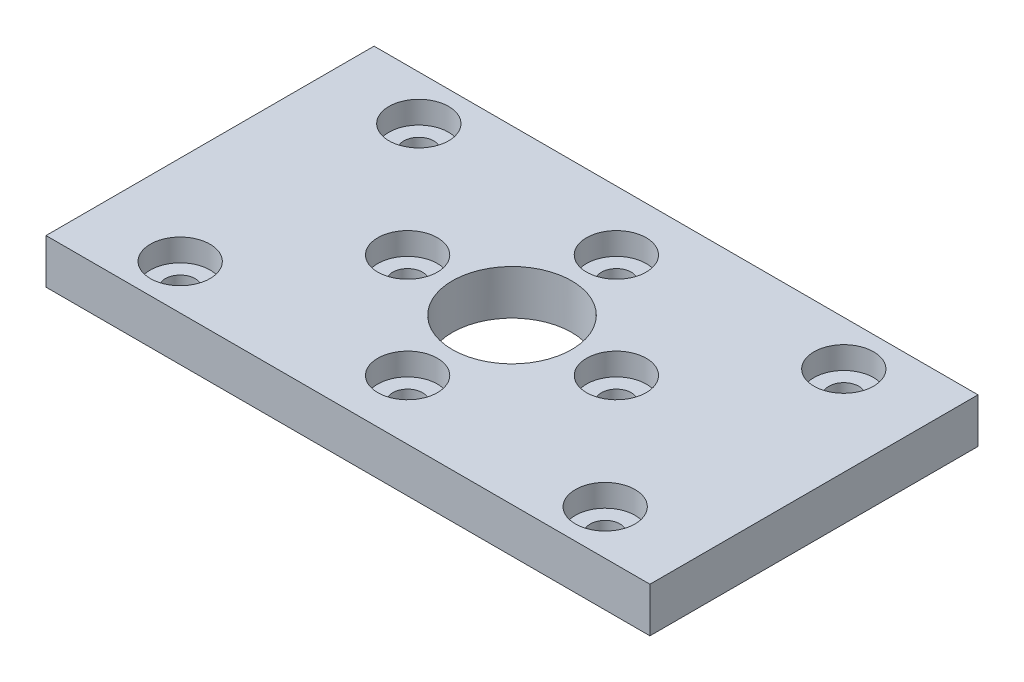
ISO-10303-21;
HEADER;
FILE_DESCRIPTION(('STEP AP214'),'2;1');
FILE_NAME('part.step','',(''),(''),'','','');
FILE_SCHEMA(('AUTOMOTIVE_DESIGN { 1 0 10303 214 1 1 1 1 }'));
ENDSEC;
DATA;
#1=APPLICATION_CONTEXT('core data for automotive mechanical design processes');
#2=APPLICATION_PROTOCOL_DEFINITION('international standard','automotive_design',2000,#1);
#3=PRODUCT_CONTEXT('',#1,'mechanical');
#4=PRODUCT('Part','Part','',(#3));
#5=PRODUCT_RELATED_PRODUCT_CATEGORY('part','',(#4));
#6=PRODUCT_DEFINITION_FORMATION('','',#4);
#7=PRODUCT_DEFINITION_CONTEXT('part definition',#1,'design');
#8=PRODUCT_DEFINITION('design','',#6,#7);
#9=PRODUCT_DEFINITION_SHAPE('','',#8);
#10=(LENGTH_UNIT() NAMED_UNIT(*) SI_UNIT(.MILLI.,.METRE.));
#11=(NAMED_UNIT(*) PLANE_ANGLE_UNIT() SI_UNIT($,.RADIAN.));
#12=(NAMED_UNIT(*) SI_UNIT($,.STERADIAN.) SOLID_ANGLE_UNIT());
#13=UNCERTAINTY_MEASURE_WITH_UNIT(LENGTH_MEASURE(1.E-05),#10,'distance_accuracy_value','');
#14=(GEOMETRIC_REPRESENTATION_CONTEXT(3) GLOBAL_UNCERTAINTY_ASSIGNED_CONTEXT((#13)) GLOBAL_UNIT_ASSIGNED_CONTEXT((#10,
#11,#12)) REPRESENTATION_CONTEXT('',''));
#15=CARTESIAN_POINT('',(0.,0.,0.));
#16=DIRECTION('',(0.,0.,1.));
#17=DIRECTION('',(1.,0.,0.));
#18=AXIS2_PLACEMENT_3D('',#15,#16,#17);
#19=CARTESIAN_POINT('',(14.25,-7.,8.));
#20=DIRECTION('',(0.,1.,0.));
#21=DIRECTION('',(0.,0.,1.));
#22=AXIS2_PLACEMENT_3D('',#19,#20,#21);
#23=CYLINDRICAL_SURFACE('',#22,1.);
#24=CARTESIAN_POINT('',(14.25,0.,8.));
#25=DIRECTION('',(0.,-1.,0.));
#26=DIRECTION('',(0.,0.,-1.));
#27=AXIS2_PLACEMENT_3D('',#24,#25,#26);
#28=CIRCLE('',#27,1.);
#29=CARTESIAN_POINT('',(14.25,0.,7.));
#30=VERTEX_POINT('',#29);
#31=EDGE_CURVE('E117',#30,#30,#28,.T.);
#32=ORIENTED_EDGE('',*,*,#31,.T.);
#33=EDGE_LOOP('',(#32));
#34=FACE_BOUND('',#33,.T.);
#35=CARTESIAN_POINT('',(14.25,1.5,8.));
#36=DIRECTION('',(0.,1.,0.));
#37=DIRECTION('',(0.,0.,1.));
#38=AXIS2_PLACEMENT_3D('',#35,#36,#37);
#39=CIRCLE('',#38,1.);
#40=CARTESIAN_POINT('',(14.25,1.5,9.));
#41=VERTEX_POINT('',#40);
#42=EDGE_CURVE('E157',#41,#41,#39,.F.);
#43=ORIENTED_EDGE('',*,*,#42,.F.);
#44=EDGE_LOOP('',(#43));
#45=FACE_BOUND('',#44,.T.);
#46=ADVANCED_FACE('F35',(#34,#45),#23,.F.);
#47=CARTESIAN_POINT('',(-14.25,-7.,8.));
#48=DIRECTION('',(0.,1.,0.));
#49=DIRECTION('',(0.,0.,1.));
#50=AXIS2_PLACEMENT_3D('',#47,#48,#49);
#51=CYLINDRICAL_SURFACE('',#50,1.);
#52=CARTESIAN_POINT('',(-14.25,0.,8.));
#53=DIRECTION('',(0.,-1.,0.));
#54=DIRECTION('',(0.,0.,-1.));
#55=AXIS2_PLACEMENT_3D('',#52,#53,#54);
#56=CIRCLE('',#55,1.);
#57=CARTESIAN_POINT('',(-14.25,0.,7.));
#58=VERTEX_POINT('',#57);
#59=EDGE_CURVE('E113',#58,#58,#56,.T.);
#60=ORIENTED_EDGE('',*,*,#59,.T.);
#61=EDGE_LOOP('',(#60));
#62=FACE_BOUND('',#61,.T.);
#63=CARTESIAN_POINT('',(-14.25,1.5,8.));
#64=DIRECTION('',(0.,1.,0.));
#65=DIRECTION('',(0.,0.,1.));
#66=AXIS2_PLACEMENT_3D('',#63,#64,#65);
#67=CIRCLE('',#66,1.);
#68=CARTESIAN_POINT('',(-14.25,1.5,9.));
#69=VERTEX_POINT('',#68);
#70=EDGE_CURVE('E155',#69,#69,#67,.F.);
#71=ORIENTED_EDGE('',*,*,#70,.F.);
#72=EDGE_LOOP('',(#71));
#73=FACE_BOUND('',#72,.T.);
#74=ADVANCED_FACE('F195',(#62,#73),#51,.F.);
#75=CARTESIAN_POINT('',(-6.9999999999998,-7.,1.98951966012828E-13));
#76=DIRECTION('',(0.,1.,0.));
#77=DIRECTION('',(0.,0.,1.));
#78=AXIS2_PLACEMENT_3D('',#75,#76,#77);
#79=CYLINDRICAL_SURFACE('',#78,1.00000000000032);
#80=CARTESIAN_POINT('',(-6.9999999999998,0.,1.98951966012828E-13));
#81=DIRECTION('',(0.,-1.,0.));
#82=DIRECTION('',(0.,0.,-1.));
#83=AXIS2_PLACEMENT_3D('',#80,#81,#82);
#84=CIRCLE('',#83,1.00000000000032);
#85=CARTESIAN_POINT('',(-6.9999999999998,0.,-1.00000000000012));
#86=VERTEX_POINT('',#85);
#87=EDGE_CURVE('E130',#86,#86,#84,.T.);
#88=ORIENTED_EDGE('',*,*,#87,.T.);
#89=EDGE_LOOP('',(#88));
#90=FACE_BOUND('',#89,.T.);
#91=CARTESIAN_POINT('',(-6.9999999999998,1.5,1.98951966012828E-13));
#92=DIRECTION('',(0.,1.,0.));
#93=DIRECTION('',(0.,0.,1.));
#94=AXIS2_PLACEMENT_3D('',#91,#92,#93);
#95=CIRCLE('',#94,1.00000000000032);
#96=CARTESIAN_POINT('',(-6.9999999999998,1.5,1.00000000000052));
#97=VERTEX_POINT('',#96);
#98=EDGE_CURVE('E149',#97,#97,#95,.F.);
#99=ORIENTED_EDGE('',*,*,#98,.F.);
#100=EDGE_LOOP('',(#99));
#101=FACE_BOUND('',#100,.T.);
#102=ADVANCED_FACE('F201',(#90,#101),#79,.F.);
#103=CARTESIAN_POINT('',(3.9618942650685E-13,-7.,7.));
#104=DIRECTION('',(0.,1.,0.));
#105=DIRECTION('',(0.,0.,1.));
#106=AXIS2_PLACEMENT_3D('',#103,#104,#105);
#107=CYLINDRICAL_SURFACE('',#106,1.00000000000043);
#108=CARTESIAN_POINT('',(3.9618942650685E-13,0.,7.));
#109=DIRECTION('',(0.,-1.,0.));
#110=DIRECTION('',(0.,0.,-1.));
#111=AXIS2_PLACEMENT_3D('',#108,#109,#110);
#112=CIRCLE('',#111,1.00000000000043);
#113=CARTESIAN_POINT('',(3.9618942650685E-13,0.,5.99999999999957));
#114=VERTEX_POINT('',#113);
#115=EDGE_CURVE('E133',#114,#114,#112,.T.);
#116=ORIENTED_EDGE('',*,*,#115,.T.);
#117=EDGE_LOOP('',(#116));
#118=FACE_BOUND('',#117,.T.);
#119=CARTESIAN_POINT('',(3.9618942650685E-13,1.5,7.));
#120=DIRECTION('',(0.,1.,0.));
#121=DIRECTION('',(0.,0.,1.));
#122=AXIS2_PLACEMENT_3D('',#119,#120,#121);
#123=CIRCLE('',#122,1.00000000000043);
#124=CARTESIAN_POINT('',(3.9618942650685E-13,1.5,8.00000000000042));
#125=VERTEX_POINT('',#124);
#126=EDGE_CURVE('E145',#125,#125,#123,.F.);
#127=ORIENTED_EDGE('',*,*,#126,.F.);
#128=EDGE_LOOP('',(#127));
#129=FACE_BOUND('',#128,.T.);
#130=ADVANCED_FACE('F225',(#118,#129),#107,.F.);
#131=CARTESIAN_POINT('',(7.0000000000002,-7.,-1.98094713253425E-13));
#132=DIRECTION('',(0.,1.,0.));
#133=DIRECTION('',(0.,0.,1.));
#134=AXIS2_PLACEMENT_3D('',#131,#132,#133);
#135=CYLINDRICAL_SURFACE('',#134,1.00000000000015);
#136=CARTESIAN_POINT('',(7.0000000000002,0.,-1.98094713253425E-13));
#137=DIRECTION('',(0.,-1.,0.));
#138=DIRECTION('',(0.,0.,-1.));
#139=AXIS2_PLACEMENT_3D('',#136,#137,#138);
#140=CIRCLE('',#139,1.00000000000015);
#141=CARTESIAN_POINT('',(7.0000000000002,0.,-1.00000000000035));
#142=VERTEX_POINT('',#141);
#143=EDGE_CURVE('E129',#142,#142,#140,.T.);
#144=ORIENTED_EDGE('',*,*,#143,.T.);
#145=EDGE_LOOP('',(#144));
#146=FACE_BOUND('',#145,.T.);
#147=CARTESIAN_POINT('',(7.0000000000002,1.5,-1.98094713253425E-13));
#148=DIRECTION('',(0.,1.,0.));
#149=DIRECTION('',(0.,0.,1.));
#150=AXIS2_PLACEMENT_3D('',#147,#148,#149);
#151=CIRCLE('',#150,1.00000000000015);
#152=CARTESIAN_POINT('',(7.0000000000002,1.5,0.999999999999957));
#153=VERTEX_POINT('',#152);
#154=EDGE_CURVE('E142',#153,#153,#151,.F.);
#155=ORIENTED_EDGE('',*,*,#154,.F.);
#156=EDGE_LOOP('',(#155));
#157=FACE_BOUND('',#156,.T.);
#158=ADVANCED_FACE('F220',(#146,#157),#135,.F.);
#159=CARTESIAN_POINT('',(20.25,3.,11.));
#160=DIRECTION('',(-1.,0.,0.));
#161=DIRECTION('',(0.,0.,1.));
#162=AXIS2_PLACEMENT_3D('',#159,#160,#161);
#163=PLANE('',#162);
#164=DIRECTION('',(0.,0.,-1.));
#165=VECTOR('',#164,1.);
#166=CARTESIAN_POINT('',(20.25,0.,11.));
#167=LINE('',#166,#165);
#168=CARTESIAN_POINT('',(20.25,0.,11.));
#169=VERTEX_POINT('',#168);
#170=CARTESIAN_POINT('',(20.25,0.,-11.));
#171=VERTEX_POINT('',#170);
#172=EDGE_CURVE('E102',#169,#171,#167,.T.);
#173=ORIENTED_EDGE('',*,*,#172,.T.);
#174=DIRECTION('',(0.,-1.,0.));
#175=VECTOR('',#174,1.);
#176=CARTESIAN_POINT('',(20.25,3.,-11.));
#177=LINE('',#176,#175);
#178=CARTESIAN_POINT('',(20.25,3.,-11.));
#179=VERTEX_POINT('',#178);
#180=EDGE_CURVE('E11',#179,#171,#177,.T.);
#181=ORIENTED_EDGE('',*,*,#180,.F.);
#182=DIRECTION('',(0.,0.,-1.));
#183=VECTOR('',#182,1.);
#184=CARTESIAN_POINT('',(20.25,3.,11.));
#185=LINE('',#184,#183);
#186=CARTESIAN_POINT('',(20.25,3.,11.));
#187=VERTEX_POINT('',#186);
#188=EDGE_CURVE('E89',#187,#179,#185,.T.);
#189=ORIENTED_EDGE('',*,*,#188,.F.);
#190=DIRECTION('',(0.,-1.,0.));
#191=VECTOR('',#190,1.);
#192=CARTESIAN_POINT('',(20.25,3.,11.));
#193=LINE('',#192,#191);
#194=EDGE_CURVE('E98',#187,#169,#193,.T.);
#195=ORIENTED_EDGE('',*,*,#194,.T.);
#196=EDGE_LOOP('',(#173,#181,#189,#195));
#197=FACE_BOUND('',#196,.T.);
#198=ADVANCED_FACE('F37',(#197),#163,.F.);
#199=CARTESIAN_POINT('',(-20.25,3.,-11.));
#200=DIRECTION('',(0.,0.,1.));
#201=DIRECTION('',(1.,0.,0.));
#202=AXIS2_PLACEMENT_3D('',#199,#200,#201);
#203=PLANE('',#202);
#204=DIRECTION('',(-1.,0.,0.));
#205=VECTOR('',#204,1.);
#206=CARTESIAN_POINT('',(-20.25,0.,-11.));
#207=LINE('',#206,#205);
#208=CARTESIAN_POINT('',(-20.25,0.,-11.));
#209=VERTEX_POINT('',#208);
#210=EDGE_CURVE('E93',#171,#209,#207,.T.);
#211=ORIENTED_EDGE('',*,*,#210,.T.);
#212=DIRECTION('',(0.,-1.,0.));
#213=VECTOR('',#212,1.);
#214=CARTESIAN_POINT('',(-20.25,3.,-11.));
#215=LINE('',#214,#213);
#216=CARTESIAN_POINT('',(-20.25,3.,-11.));
#217=VERTEX_POINT('',#216);
#218=EDGE_CURVE('E45',#217,#209,#215,.T.);
#219=ORIENTED_EDGE('',*,*,#218,.F.);
#220=DIRECTION('',(-1.,0.,0.));
#221=VECTOR('',#220,1.);
#222=CARTESIAN_POINT('',(-20.25,3.,-11.));
#223=LINE('',#222,#221);
#224=EDGE_CURVE('E84',#179,#217,#223,.T.);
#225=ORIENTED_EDGE('',*,*,#224,.F.);
#226=ORIENTED_EDGE('',*,*,#180,.T.);
#227=EDGE_LOOP('',(#211,#219,#225,#226));
#228=FACE_BOUND('',#227,.T.);
#229=ADVANCED_FACE('F92',(#228),#203,.F.);
#230=CARTESIAN_POINT('',(-20.25,3.,11.));
#231=DIRECTION('',(1.,0.,0.));
#232=DIRECTION('',(0.,0.,-1.));
#233=AXIS2_PLACEMENT_3D('',#230,#231,#232);
#234=PLANE('',#233);
#235=DIRECTION('',(0.,0.,1.));
#236=VECTOR('',#235,1.);
#237=CARTESIAN_POINT('',(-20.25,0.,11.));
#238=LINE('',#237,#236);
#239=CARTESIAN_POINT('',(-20.25,0.,11.));
#240=VERTEX_POINT('',#239);
#241=EDGE_CURVE('E71',#209,#240,#238,.T.);
#242=ORIENTED_EDGE('',*,*,#241,.T.);
#243=DIRECTION('',(0.,-1.,0.));
#244=VECTOR('',#243,1.);
#245=CARTESIAN_POINT('',(-20.25,3.,11.));
#246=LINE('',#245,#244);
#247=CARTESIAN_POINT('',(-20.25,3.,11.));
#248=VERTEX_POINT('',#247);
#249=EDGE_CURVE('E94',#248,#240,#246,.T.);
#250=ORIENTED_EDGE('',*,*,#249,.F.);
#251=DIRECTION('',(0.,0.,1.));
#252=VECTOR('',#251,1.);
#253=CARTESIAN_POINT('',(-20.25,3.,11.));
#254=LINE('',#253,#252);
#255=EDGE_CURVE('E87',#217,#248,#254,.T.);
#256=ORIENTED_EDGE('',*,*,#255,.F.);
#257=ORIENTED_EDGE('',*,*,#218,.T.);
#258=EDGE_LOOP('',(#242,#250,#256,#257));
#259=FACE_BOUND('',#258,.T.);
#260=ADVANCED_FACE('F96',(#259),#234,.F.);
#261=CARTESIAN_POINT('',(-20.25,3.,11.));
#262=DIRECTION('',(0.,0.,-1.));
#263=DIRECTION('',(-1.,0.,0.));
#264=AXIS2_PLACEMENT_3D('',#261,#262,#263);
#265=PLANE('',#264);
#266=DIRECTION('',(1.,0.,0.));
#267=VECTOR('',#266,1.);
#268=CARTESIAN_POINT('',(-20.25,0.,11.));
#269=LINE('',#268,#267);
#270=EDGE_CURVE('E77',#240,#169,#269,.T.);
#271=ORIENTED_EDGE('',*,*,#270,.T.);
#272=ORIENTED_EDGE('',*,*,#194,.F.);
#273=DIRECTION('',(1.,0.,0.));
#274=VECTOR('',#273,1.);
#275=CARTESIAN_POINT('',(-20.25,3.,11.));
#276=LINE('',#275,#274);
#277=EDGE_CURVE('E54',#248,#187,#276,.T.);
#278=ORIENTED_EDGE('',*,*,#277,.F.);
#279=ORIENTED_EDGE('',*,*,#249,.T.);
#280=EDGE_LOOP('',(#271,#272,#278,#279));
#281=FACE_BOUND('',#280,.T.);
#282=ADVANCED_FACE('F180',(#281),#265,.F.);
#283=CARTESIAN_POINT('',(0.,3.,0.));
#284=DIRECTION('',(0.,-1.,0.));
#285=DIRECTION('',(0.,0.,-1.));
#286=AXIS2_PLACEMENT_3D('',#283,#284,#285);
#287=PLANE('',#286);
#288=CARTESIAN_POINT('',(-14.25,3.,8.));
#289=DIRECTION('',(0.,1.,0.));
#290=DIRECTION('',(0.,0.,1.));
#291=AXIS2_PLACEMENT_3D('',#288,#289,#290);
#292=CIRCLE('',#291,2.);
#293=CARTESIAN_POINT('',(-14.25,3.,10.));
#294=VERTEX_POINT('',#293);
#295=EDGE_CURVE('E417',#294,#294,#292,.T.);
#296=ORIENTED_EDGE('',*,*,#295,.F.);
#297=EDGE_LOOP('',(#296));
#298=FACE_BOUND('',#297,.T.);
#299=CARTESIAN_POINT('',(3.9618942650685E-13,3.,7.));
#300=DIRECTION('',(0.,1.,0.));
#301=DIRECTION('',(0.,0.,1.));
#302=AXIS2_PLACEMENT_3D('',#299,#300,#301);
#303=CIRCLE('',#302,2.);
#304=CARTESIAN_POINT('',(3.9618942650685E-13,3.,9.));
#305=VERTEX_POINT('',#304);
#306=EDGE_CURVE('E423',#305,#305,#303,.T.);
#307=ORIENTED_EDGE('',*,*,#306,.F.);
#308=EDGE_LOOP('',(#307));
#309=FACE_BOUND('',#308,.T.);
#310=CARTESIAN_POINT('',(14.25,3.,8.));
#311=DIRECTION('',(0.,1.,0.));
#312=DIRECTION('',(0.,0.,1.));
#313=AXIS2_PLACEMENT_3D('',#310,#311,#312);
#314=CIRCLE('',#313,2.);
#315=CARTESIAN_POINT('',(14.25,3.,10.));
#316=VERTEX_POINT('',#315);
#317=EDGE_CURVE('E410',#316,#316,#314,.T.);
#318=ORIENTED_EDGE('',*,*,#317,.F.);
#319=EDGE_LOOP('',(#318));
#320=FACE_BOUND('',#319,.T.);
#321=CARTESIAN_POINT('',(-14.2500000000001,3.,-7.99999999999969));
#322=DIRECTION('',(0.,1.,0.));
#323=DIRECTION('',(0.,0.,-1.));
#324=AXIS2_PLACEMENT_3D('',#321,#322,#323);
#325=CIRCLE('',#324,2.);
#326=CARTESIAN_POINT('',(-14.2500000000001,3.,-9.99999999999969));
#327=VERTEX_POINT('',#326);
#328=EDGE_CURVE('E407',#327,#327,#325,.T.);
#329=ORIENTED_EDGE('',*,*,#328,.F.);
#330=EDGE_LOOP('',(#329));
#331=FACE_BOUND('',#330,.T.);
#332=CARTESIAN_POINT('',(-6.9999999999998,3.,1.98951966012828E-13));
#333=DIRECTION('',(0.,1.,0.));
#334=DIRECTION('',(0.,0.,1.));
#335=AXIS2_PLACEMENT_3D('',#332,#333,#334);
#336=CIRCLE('',#335,2.);
#337=CARTESIAN_POINT('',(-6.9999999999998,3.,2.0000000000002));
#338=VERTEX_POINT('',#337);
#339=EDGE_CURVE('E416',#338,#338,#336,.T.);
#340=ORIENTED_EDGE('',*,*,#339,.F.);
#341=EDGE_LOOP('',(#340));
#342=FACE_BOUND('',#341,.T.);
#343=CARTESIAN_POINT('',(7.0000000000002,3.,-1.98094713253425E-13));
#344=DIRECTION('',(0.,1.,0.));
#345=DIRECTION('',(0.,0.,1.));
#346=AXIS2_PLACEMENT_3D('',#343,#344,#345);
#347=CIRCLE('',#346,2.);
#348=CARTESIAN_POINT('',(7.0000000000002,3.,1.9999999999998));
#349=VERTEX_POINT('',#348);
#350=EDGE_CURVE('E435',#349,#349,#347,.T.);
#351=ORIENTED_EDGE('',*,*,#350,.F.);
#352=EDGE_LOOP('',(#351));
#353=FACE_BOUND('',#352,.T.);
#354=CARTESIAN_POINT('',(3.40678275275592E-13,3.,-6.99999999999981));
#355=DIRECTION('',(0.,1.,0.));
#356=DIRECTION('',(0.,0.,-1.));
#357=AXIS2_PLACEMENT_3D('',#354,#355,#356);
#358=CIRCLE('',#357,2.);
#359=CARTESIAN_POINT('',(3.40678275275592E-13,3.,-8.99999999999981));
#360=VERTEX_POINT('',#359);
#361=EDGE_CURVE('E429',#360,#360,#358,.T.);
#362=ORIENTED_EDGE('',*,*,#361,.F.);
#363=EDGE_LOOP('',(#362));
#364=FACE_BOUND('',#363,.T.);
#365=CARTESIAN_POINT('',(14.2499999999999,3.,-7.99999999999992));
#366=DIRECTION('',(0.,1.,0.));
#367=DIRECTION('',(0.,0.,-1.));
#368=AXIS2_PLACEMENT_3D('',#365,#366,#367);
#369=CIRCLE('',#368,2.);
#370=CARTESIAN_POINT('',(14.2499999999999,3.,-9.99999999999991));
#371=VERTEX_POINT('',#370);
#372=EDGE_CURVE('E162',#371,#371,#369,.T.);
#373=ORIENTED_EDGE('',*,*,#372,.F.);
#374=EDGE_LOOP('',(#373));
#375=FACE_BOUND('',#374,.T.);
#376=CARTESIAN_POINT('',(0.,3.,0.));
#377=DIRECTION('',(0.,1.,0.));
#378=DIRECTION('',(0.,0.,1.));
#379=AXIS2_PLACEMENT_3D('',#376,#377,#378);
#380=CIRCLE('',#379,4.);
#381=CARTESIAN_POINT('',(0.,3.,4.));
#382=VERTEX_POINT('',#381);
#383=EDGE_CURVE('E125',#382,#382,#380,.T.);
#384=ORIENTED_EDGE('',*,*,#383,.F.);
#385=EDGE_LOOP('',(#384));
#386=FACE_BOUND('',#385,.T.);
#387=ORIENTED_EDGE('',*,*,#188,.T.);
#388=ORIENTED_EDGE('',*,*,#224,.T.);
#389=ORIENTED_EDGE('',*,*,#255,.T.);
#390=ORIENTED_EDGE('',*,*,#277,.T.);
#391=EDGE_LOOP('',(#387,#388,#389,#390));
#392=FACE_BOUND('',#391,.T.);
#393=ADVANCED_FACE('F85',(#298,#309,#320,#331,#342,#353,#364,#375,#386,#392),#287,.F.);
#394=CARTESIAN_POINT('',(0.,0.,0.));
#395=DIRECTION('',(0.,-1.,0.));
#396=DIRECTION('',(0.,0.,-1.));
#397=AXIS2_PLACEMENT_3D('',#394,#395,#396);
#398=PLANE('',#397);
#399=ORIENTED_EDGE('',*,*,#143,.F.);
#400=EDGE_LOOP('',(#399));
#401=FACE_BOUND('',#400,.T.);
#402=ORIENTED_EDGE('',*,*,#115,.F.);
#403=EDGE_LOOP('',(#402));
#404=FACE_BOUND('',#403,.T.);
#405=ORIENTED_EDGE('',*,*,#87,.F.);
#406=EDGE_LOOP('',(#405));
#407=FACE_BOUND('',#406,.T.);
#408=CARTESIAN_POINT('',(0.,0.,-7.));
#409=DIRECTION('',(0.,-1.,0.));
#410=DIRECTION('',(0.,0.,-1.));
#411=AXIS2_PLACEMENT_3D('',#408,#409,#410);
#412=CIRCLE('',#411,1.);
#413=CARTESIAN_POINT('',(0.,0.,-8.));
#414=VERTEX_POINT('',#413);
#415=EDGE_CURVE('E126',#414,#414,#412,.T.);
#416=ORIENTED_EDGE('',*,*,#415,.F.);
#417=EDGE_LOOP('',(#416));
#418=FACE_BOUND('',#417,.T.);
#419=CARTESIAN_POINT('',(0.,0.,0.));
#420=DIRECTION('',(0.,-1.,0.));
#421=DIRECTION('',(0.,0.,-1.));
#422=AXIS2_PLACEMENT_3D('',#419,#420,#421);
#423=CIRCLE('',#422,4.);
#424=CARTESIAN_POINT('',(0.,0.,-4.));
#425=VERTEX_POINT('',#424);
#426=EDGE_CURVE('E118',#425,#425,#423,.T.);
#427=ORIENTED_EDGE('',*,*,#426,.F.);
#428=EDGE_LOOP('',(#427));
#429=FACE_BOUND('',#428,.T.);
#430=ORIENTED_EDGE('',*,*,#59,.F.);
#431=EDGE_LOOP('',(#430));
#432=FACE_BOUND('',#431,.T.);
#433=ORIENTED_EDGE('',*,*,#31,.F.);
#434=EDGE_LOOP('',(#433));
#435=FACE_BOUND('',#434,.T.);
#436=CARTESIAN_POINT('',(14.25,0.,-7.99999999999999));
#437=DIRECTION('',(0.,-1.,0.));
#438=DIRECTION('',(0.,0.,-1.));
#439=AXIS2_PLACEMENT_3D('',#436,#437,#438);
#440=CIRCLE('',#439,0.999999999999999);
#441=CARTESIAN_POINT('',(14.25,0.,-8.99999999999999));
#442=VERTEX_POINT('',#441);
#443=EDGE_CURVE('E114',#442,#442,#440,.T.);
#444=ORIENTED_EDGE('',*,*,#443,.F.);
#445=EDGE_LOOP('',(#444));
#446=FACE_BOUND('',#445,.T.);
#447=CARTESIAN_POINT('',(-14.25,0.,-8.));
#448=DIRECTION('',(0.,-1.,0.));
#449=DIRECTION('',(0.,0.,-1.));
#450=AXIS2_PLACEMENT_3D('',#447,#448,#449);
#451=CIRCLE('',#450,0.999999999999999);
#452=CARTESIAN_POINT('',(-14.25,0.,-9.));
#453=VERTEX_POINT('',#452);
#454=EDGE_CURVE('E105',#453,#453,#451,.T.);
#455=ORIENTED_EDGE('',*,*,#454,.F.);
#456=EDGE_LOOP('',(#455));
#457=FACE_BOUND('',#456,.T.);
#458=ORIENTED_EDGE('',*,*,#172,.F.);
#459=ORIENTED_EDGE('',*,*,#270,.F.);
#460=ORIENTED_EDGE('',*,*,#241,.F.);
#461=ORIENTED_EDGE('',*,*,#210,.F.);
#462=EDGE_LOOP('',(#458,#459,#460,#461));
#463=FACE_BOUND('',#462,.T.);
#464=ADVANCED_FACE('F179',(#401,#404,#407,#418,#429,#432,#435,#446,#457,#463),#398,.T.);
#465=CARTESIAN_POINT('',(-14.25,-7.,-8.));
#466=DIRECTION('',(0.,1.,0.));
#467=DIRECTION('',(0.,0.,1.));
#468=AXIS2_PLACEMENT_3D('',#465,#466,#467);
#469=CYLINDRICAL_SURFACE('',#468,0.999999999999999);
#470=CARTESIAN_POINT('',(-14.25,1.5,-8.));
#471=DIRECTION('',(0.,-1.,0.));
#472=DIRECTION('',(0.,0.,-1.));
#473=AXIS2_PLACEMENT_3D('',#470,#471,#472);
#474=CIRCLE('',#473,0.999999999999999);
#475=CARTESIAN_POINT('',(-14.25,1.5,-9.));
#476=VERTEX_POINT('',#475);
#477=EDGE_CURVE('E39',#476,#476,#474,.F.);
#478=ORIENTED_EDGE('',*,*,#477,.T.);
#479=EDGE_LOOP('',(#478));
#480=FACE_BOUND('',#479,.T.);
#481=ORIENTED_EDGE('',*,*,#454,.T.);
#482=EDGE_LOOP('',(#481));
#483=FACE_BOUND('',#482,.T.);
#484=ADVANCED_FACE('F187',(#480,#483),#469,.F.);
#485=CARTESIAN_POINT('',(14.25,-7.,-7.99999999999999));
#486=DIRECTION('',(0.,1.,0.));
#487=DIRECTION('',(0.,0.,1.));
#488=AXIS2_PLACEMENT_3D('',#485,#486,#487);
#489=CYLINDRICAL_SURFACE('',#488,0.999999999999999);
#490=CARTESIAN_POINT('',(14.25,1.5,-7.99999999999999));
#491=DIRECTION('',(0.,-1.,0.));
#492=DIRECTION('',(0.,0.,-1.));
#493=AXIS2_PLACEMENT_3D('',#490,#491,#492);
#494=CIRCLE('',#493,0.999999999999999);
#495=CARTESIAN_POINT('',(14.25,1.5,-8.99999999999999));
#496=VERTEX_POINT('',#495);
#497=EDGE_CURVE('E134',#496,#496,#494,.F.);
#498=ORIENTED_EDGE('',*,*,#497,.T.);
#499=EDGE_LOOP('',(#498));
#500=FACE_BOUND('',#499,.T.);
#501=ORIENTED_EDGE('',*,*,#443,.T.);
#502=EDGE_LOOP('',(#501));
#503=FACE_BOUND('',#502,.T.);
#504=ADVANCED_FACE('F207',(#500,#503),#489,.F.);
#505=CARTESIAN_POINT('',(0.,-7.,0.));
#506=DIRECTION('',(0.,1.,0.));
#507=DIRECTION('',(0.,0.,1.));
#508=AXIS2_PLACEMENT_3D('',#505,#506,#507);
#509=CYLINDRICAL_SURFACE('',#508,4.);
#510=ORIENTED_EDGE('',*,*,#426,.T.);
#511=EDGE_LOOP('',(#510));
#512=FACE_BOUND('',#511,.T.);
#513=ORIENTED_EDGE('',*,*,#383,.T.);
#514=EDGE_LOOP('',(#513));
#515=FACE_BOUND('',#514,.T.);
#516=ADVANCED_FACE('F176',(#512,#515),#509,.F.);
#517=CARTESIAN_POINT('',(0.,-7.,-7.));
#518=DIRECTION('',(0.,1.,0.));
#519=DIRECTION('',(0.,0.,1.));
#520=AXIS2_PLACEMENT_3D('',#517,#518,#519);
#521=CYLINDRICAL_SURFACE('',#520,1.);
#522=CARTESIAN_POINT('',(0.,1.5,-7.));
#523=DIRECTION('',(0.,-1.,0.));
#524=DIRECTION('',(0.,0.,-1.));
#525=AXIS2_PLACEMENT_3D('',#522,#523,#524);
#526=CIRCLE('',#525,1.);
#527=CARTESIAN_POINT('',(0.,1.5,-8.));
#528=VERTEX_POINT('',#527);
#529=EDGE_CURVE('E152',#528,#528,#526,.F.);
#530=ORIENTED_EDGE('',*,*,#529,.T.);
#531=EDGE_LOOP('',(#530));
#532=FACE_BOUND('',#531,.T.);
#533=ORIENTED_EDGE('',*,*,#415,.T.);
#534=EDGE_LOOP('',(#533));
#535=FACE_BOUND('',#534,.T.);
#536=ADVANCED_FACE('F241',(#532,#535),#521,.F.);
#537=CARTESIAN_POINT('',(14.2499999999999,1.5,-7.99999999999992));
#538=DIRECTION('',(0.,-1.,0.));
#539=DIRECTION('',(0.,0.,-1.));
#540=AXIS2_PLACEMENT_3D('',#537,#538,#539);
#541=PLANE('',#540);
#542=CARTESIAN_POINT('',(14.2499999999999,1.5,-7.99999999999992));
#543=DIRECTION('',(0.,1.,0.));
#544=DIRECTION('',(0.,0.,-1.));
#545=AXIS2_PLACEMENT_3D('',#542,#543,#544);
#546=CIRCLE('',#545,2.);
#547=CARTESIAN_POINT('',(14.2499999999999,1.5,-9.99999999999991));
#548=VERTEX_POINT('',#547);
#549=EDGE_CURVE('E141',#548,#548,#546,.T.);
#550=ORIENTED_EDGE('',*,*,#549,.T.);
#551=EDGE_LOOP('',(#550));
#552=FACE_BOUND('',#551,.T.);
#553=ORIENTED_EDGE('',*,*,#497,.F.);
#554=EDGE_LOOP('',(#553));
#555=FACE_BOUND('',#554,.T.);
#556=ADVANCED_FACE('F243',(#552,#555),#541,.F.);
#557=CARTESIAN_POINT('',(14.2499999999999,1.5,-7.99999999999992));
#558=DIRECTION('',(0.,1.,0.));
#559=DIRECTION('',(0.,0.,1.));
#560=AXIS2_PLACEMENT_3D('',#557,#558,#559);
#561=CYLINDRICAL_SURFACE('',#560,2.);
#562=ORIENTED_EDGE('',*,*,#549,.F.);
#563=EDGE_LOOP('',(#562));
#564=FACE_BOUND('',#563,.T.);
#565=ORIENTED_EDGE('',*,*,#372,.T.);
#566=EDGE_LOOP('',(#565));
#567=FACE_BOUND('',#566,.T.);
#568=ADVANCED_FACE('F235',(#564,#567),#561,.F.);
#569=CARTESIAN_POINT('',(7.0000000000002,1.5,-1.98094713253425E-13));
#570=DIRECTION('',(0.,1.,0.));
#571=DIRECTION('',(0.,0.,1.));
#572=AXIS2_PLACEMENT_3D('',#569,#570,#571);
#573=PLANE('',#572);
#574=CARTESIAN_POINT('',(7.0000000000002,1.5,-1.98094713253425E-13));
#575=DIRECTION('',(0.,1.,0.));
#576=DIRECTION('',(0.,0.,1.));
#577=AXIS2_PLACEMENT_3D('',#574,#575,#576);
#578=CIRCLE('',#577,2.);
#579=CARTESIAN_POINT('',(7.0000000000002,1.5,1.9999999999998));
#580=VERTEX_POINT('',#579);
#581=EDGE_CURVE('E432',#580,#580,#578,.T.);
#582=ORIENTED_EDGE('',*,*,#581,.T.);
#583=EDGE_LOOP('',(#582));
#584=FACE_BOUND('',#583,.T.);
#585=ORIENTED_EDGE('',*,*,#154,.T.);
#586=EDGE_LOOP('',(#585));
#587=FACE_BOUND('',#586,.T.);
#588=ADVANCED_FACE('F296',(#584,#587),#573,.T.);
#589=CARTESIAN_POINT('',(7.0000000000002,1.5,-1.98094713253425E-13));
#590=DIRECTION('',(0.,1.,0.));
#591=DIRECTION('',(0.,0.,1.));
#592=AXIS2_PLACEMENT_3D('',#589,#590,#591);
#593=CYLINDRICAL_SURFACE('',#592,2.);
#594=ORIENTED_EDGE('',*,*,#581,.F.);
#595=EDGE_LOOP('',(#594));
#596=FACE_BOUND('',#595,.T.);
#597=ORIENTED_EDGE('',*,*,#350,.T.);
#598=EDGE_LOOP('',(#597));
#599=FACE_BOUND('',#598,.T.);
#600=ADVANCED_FACE('F286',(#596,#599),#593,.F.);
#601=CARTESIAN_POINT('',(3.9618942650685E-13,1.5,7.));
#602=DIRECTION('',(0.,1.,0.));
#603=DIRECTION('',(0.,0.,1.));
#604=AXIS2_PLACEMENT_3D('',#601,#602,#603);
#605=PLANE('',#604);
#606=CARTESIAN_POINT('',(3.9618942650685E-13,1.5,7.));
#607=DIRECTION('',(0.,1.,0.));
#608=DIRECTION('',(0.,0.,1.));
#609=AXIS2_PLACEMENT_3D('',#606,#607,#608);
#610=CIRCLE('',#609,2.);
#611=CARTESIAN_POINT('',(3.9618942650685E-13,1.5,9.));
#612=VERTEX_POINT('',#611);
#613=EDGE_CURVE('E420',#612,#612,#610,.T.);
#614=ORIENTED_EDGE('',*,*,#613,.T.);
#615=EDGE_LOOP('',(#614));
#616=FACE_BOUND('',#615,.T.);
#617=ORIENTED_EDGE('',*,*,#126,.T.);
#618=EDGE_LOOP('',(#617));
#619=FACE_BOUND('',#618,.T.);
#620=ADVANCED_FACE('F282',(#616,#619),#605,.T.);
#621=CARTESIAN_POINT('',(3.9618942650685E-13,1.5,7.));
#622=DIRECTION('',(0.,1.,0.));
#623=DIRECTION('',(0.,0.,1.));
#624=AXIS2_PLACEMENT_3D('',#621,#622,#623);
#625=CYLINDRICAL_SURFACE('',#624,2.);
#626=ORIENTED_EDGE('',*,*,#613,.F.);
#627=EDGE_LOOP('',(#626));
#628=FACE_BOUND('',#627,.T.);
#629=ORIENTED_EDGE('',*,*,#306,.T.);
#630=EDGE_LOOP('',(#629));
#631=FACE_BOUND('',#630,.T.);
#632=ADVANCED_FACE('F285',(#628,#631),#625,.F.);
#633=CARTESIAN_POINT('',(-6.9999999999998,1.5,1.98951966012828E-13));
#634=DIRECTION('',(0.,1.,0.));
#635=DIRECTION('',(0.,0.,1.));
#636=AXIS2_PLACEMENT_3D('',#633,#634,#635);
#637=PLANE('',#636);
#638=CARTESIAN_POINT('',(-6.9999999999998,1.5,1.98951966012828E-13));
#639=DIRECTION('',(0.,1.,0.));
#640=DIRECTION('',(0.,0.,1.));
#641=AXIS2_PLACEMENT_3D('',#638,#639,#640);
#642=CIRCLE('',#641,2.);
#643=CARTESIAN_POINT('',(-6.9999999999998,1.5,2.0000000000002));
#644=VERTEX_POINT('',#643);
#645=EDGE_CURVE('E438',#644,#644,#642,.T.);
#646=ORIENTED_EDGE('',*,*,#645,.T.);
#647=EDGE_LOOP('',(#646));
#648=FACE_BOUND('',#647,.T.);
#649=ORIENTED_EDGE('',*,*,#98,.T.);
#650=EDGE_LOOP('',(#649));
#651=FACE_BOUND('',#650,.T.);
#652=ADVANCED_FACE('F290',(#648,#651),#637,.T.);
#653=CARTESIAN_POINT('',(-6.9999999999998,1.5,1.98951966012828E-13));
#654=DIRECTION('',(0.,1.,0.));
#655=DIRECTION('',(0.,0.,1.));
#656=AXIS2_PLACEMENT_3D('',#653,#654,#655);
#657=CYLINDRICAL_SURFACE('',#656,2.);
#658=ORIENTED_EDGE('',*,*,#645,.F.);
#659=EDGE_LOOP('',(#658));
#660=FACE_BOUND('',#659,.T.);
#661=ORIENTED_EDGE('',*,*,#339,.T.);
#662=EDGE_LOOP('',(#661));
#663=FACE_BOUND('',#662,.T.);
#664=ADVANCED_FACE('F293',(#660,#663),#657,.F.);
#665=CARTESIAN_POINT('',(3.40678275275592E-13,1.5,-6.99999999999981));
#666=DIRECTION('',(0.,-1.,0.));
#667=DIRECTION('',(0.,0.,-1.));
#668=AXIS2_PLACEMENT_3D('',#665,#666,#667);
#669=PLANE('',#668);
#670=CARTESIAN_POINT('',(3.40678275275592E-13,1.5,-6.99999999999981));
#671=DIRECTION('',(0.,1.,0.));
#672=DIRECTION('',(0.,0.,-1.));
#673=AXIS2_PLACEMENT_3D('',#670,#671,#672);
#674=CIRCLE('',#673,2.);
#675=CARTESIAN_POINT('',(3.40678275275592E-13,1.5,-8.99999999999981));
#676=VERTEX_POINT('',#675);
#677=EDGE_CURVE('E146',#676,#676,#674,.T.);
#678=ORIENTED_EDGE('',*,*,#677,.T.);
#679=EDGE_LOOP('',(#678));
#680=FACE_BOUND('',#679,.T.);
#681=ORIENTED_EDGE('',*,*,#529,.F.);
#682=EDGE_LOOP('',(#681));
#683=FACE_BOUND('',#682,.T.);
#684=ADVANCED_FACE('F274',(#680,#683),#669,.F.);
#685=CARTESIAN_POINT('',(3.40678275275592E-13,1.5,-6.99999999999981));
#686=DIRECTION('',(0.,1.,0.));
#687=DIRECTION('',(0.,0.,1.));
#688=AXIS2_PLACEMENT_3D('',#685,#686,#687);
#689=CYLINDRICAL_SURFACE('',#688,2.);
#690=ORIENTED_EDGE('',*,*,#677,.F.);
#691=EDGE_LOOP('',(#690));
#692=FACE_BOUND('',#691,.T.);
#693=ORIENTED_EDGE('',*,*,#361,.T.);
#694=EDGE_LOOP('',(#693));
#695=FACE_BOUND('',#694,.T.);
#696=ADVANCED_FACE('F264',(#692,#695),#689,.F.);
#697=CARTESIAN_POINT('',(-14.25,1.5,8.));
#698=DIRECTION('',(0.,1.,0.));
#699=DIRECTION('',(0.,0.,1.));
#700=AXIS2_PLACEMENT_3D('',#697,#698,#699);
#701=PLANE('',#700);
#702=CARTESIAN_POINT('',(-14.25,1.5,8.));
#703=DIRECTION('',(0.,1.,0.));
#704=DIRECTION('',(0.,0.,1.));
#705=AXIS2_PLACEMENT_3D('',#702,#703,#704);
#706=CIRCLE('',#705,2.);
#707=CARTESIAN_POINT('',(-14.25,1.5,10.));
#708=VERTEX_POINT('',#707);
#709=EDGE_CURVE('E414',#708,#708,#706,.T.);
#710=ORIENTED_EDGE('',*,*,#709,.T.);
#711=EDGE_LOOP('',(#710));
#712=FACE_BOUND('',#711,.T.);
#713=ORIENTED_EDGE('',*,*,#70,.T.);
#714=EDGE_LOOP('',(#713));
#715=FACE_BOUND('',#714,.T.);
#716=ADVANCED_FACE('F261',(#712,#715),#701,.T.);
#717=CARTESIAN_POINT('',(-14.25,1.5,8.));
#718=DIRECTION('',(0.,1.,0.));
#719=DIRECTION('',(0.,0.,1.));
#720=AXIS2_PLACEMENT_3D('',#717,#718,#719);
#721=CYLINDRICAL_SURFACE('',#720,2.);
#722=ORIENTED_EDGE('',*,*,#709,.F.);
#723=EDGE_LOOP('',(#722));
#724=FACE_BOUND('',#723,.T.);
#725=ORIENTED_EDGE('',*,*,#295,.T.);
#726=EDGE_LOOP('',(#725));
#727=FACE_BOUND('',#726,.T.);
#728=ADVANCED_FACE('F263',(#724,#727),#721,.F.);
#729=CARTESIAN_POINT('',(14.25,1.5,8.));
#730=DIRECTION('',(0.,1.,0.));
#731=DIRECTION('',(0.,0.,1.));
#732=AXIS2_PLACEMENT_3D('',#729,#730,#731);
#733=PLANE('',#732);
#734=CARTESIAN_POINT('',(14.25,1.5,8.));
#735=DIRECTION('',(0.,1.,0.));
#736=DIRECTION('',(0.,0.,1.));
#737=AXIS2_PLACEMENT_3D('',#734,#735,#736);
#738=CIRCLE('',#737,2.);
#739=CARTESIAN_POINT('',(14.25,1.5,10.));
#740=VERTEX_POINT('',#739);
#741=EDGE_CURVE('E426',#740,#740,#738,.T.);
#742=ORIENTED_EDGE('',*,*,#741,.T.);
#743=EDGE_LOOP('',(#742));
#744=FACE_BOUND('',#743,.T.);
#745=ORIENTED_EDGE('',*,*,#42,.T.);
#746=EDGE_LOOP('',(#745));
#747=FACE_BOUND('',#746,.T.);
#748=ADVANCED_FACE('F271',(#744,#747),#733,.T.);
#749=CARTESIAN_POINT('',(14.25,1.5,8.));
#750=DIRECTION('',(0.,1.,0.));
#751=DIRECTION('',(0.,0.,1.));
#752=AXIS2_PLACEMENT_3D('',#749,#750,#751);
#753=CYLINDRICAL_SURFACE('',#752,2.);
#754=ORIENTED_EDGE('',*,*,#741,.F.);
#755=EDGE_LOOP('',(#754));
#756=FACE_BOUND('',#755,.T.);
#757=ORIENTED_EDGE('',*,*,#317,.T.);
#758=EDGE_LOOP('',(#757));
#759=FACE_BOUND('',#758,.T.);
#760=ADVANCED_FACE('F370',(#756,#759),#753,.F.);
#761=CARTESIAN_POINT('',(-14.2500000000001,1.5,-7.99999999999969));
#762=DIRECTION('',(0.,-1.,0.));
#763=DIRECTION('',(0.,0.,-1.));
#764=AXIS2_PLACEMENT_3D('',#761,#762,#763);
#765=PLANE('',#764);
#766=CARTESIAN_POINT('',(-14.2500000000001,1.5,-7.99999999999969));
#767=DIRECTION('',(0.,1.,0.));
#768=DIRECTION('',(0.,0.,-1.));
#769=AXIS2_PLACEMENT_3D('',#766,#767,#768);
#770=CIRCLE('',#769,2.);
#771=CARTESIAN_POINT('',(-14.2500000000001,1.5,-9.99999999999969));
#772=VERTEX_POINT('',#771);
#773=EDGE_CURVE('E404',#772,#772,#770,.T.);
#774=ORIENTED_EDGE('',*,*,#773,.T.);
#775=EDGE_LOOP('',(#774));
#776=FACE_BOUND('',#775,.T.);
#777=ORIENTED_EDGE('',*,*,#477,.F.);
#778=EDGE_LOOP('',(#777));
#779=FACE_BOUND('',#778,.T.);
#780=ADVANCED_FACE('F380',(#776,#779),#765,.F.);
#781=CARTESIAN_POINT('',(-14.2500000000001,1.5,-7.99999999999969));
#782=DIRECTION('',(0.,1.,0.));
#783=DIRECTION('',(0.,0.,1.));
#784=AXIS2_PLACEMENT_3D('',#781,#782,#783);
#785=CYLINDRICAL_SURFACE('',#784,2.);
#786=ORIENTED_EDGE('',*,*,#773,.F.);
#787=EDGE_LOOP('',(#786));
#788=FACE_BOUND('',#787,.T.);
#789=ORIENTED_EDGE('',*,*,#328,.T.);
#790=EDGE_LOOP('',(#789));
#791=FACE_BOUND('',#790,.T.);
#792=ADVANCED_FACE('F279',(#788,#791),#785,.F.);
#793=CLOSED_SHELL('',(#46,#74,#102,#130,#158,#198,#229,#260,#282,#393,#464,#484,#504,#516,#536,
#556,#568,#588,#600,#620,#632,#652,#664,#684,#696,#716,#728,#748,#760,#780,#792));
#794=MANIFOLD_SOLID_BREP('B2',#793);
#795=ADVANCED_BREP_SHAPE_REPRESENTATION('',(#18,#794),#14);
#796=SHAPE_DEFINITION_REPRESENTATION(#9,#795);
ENDSEC;
END-ISO-10303-21;
